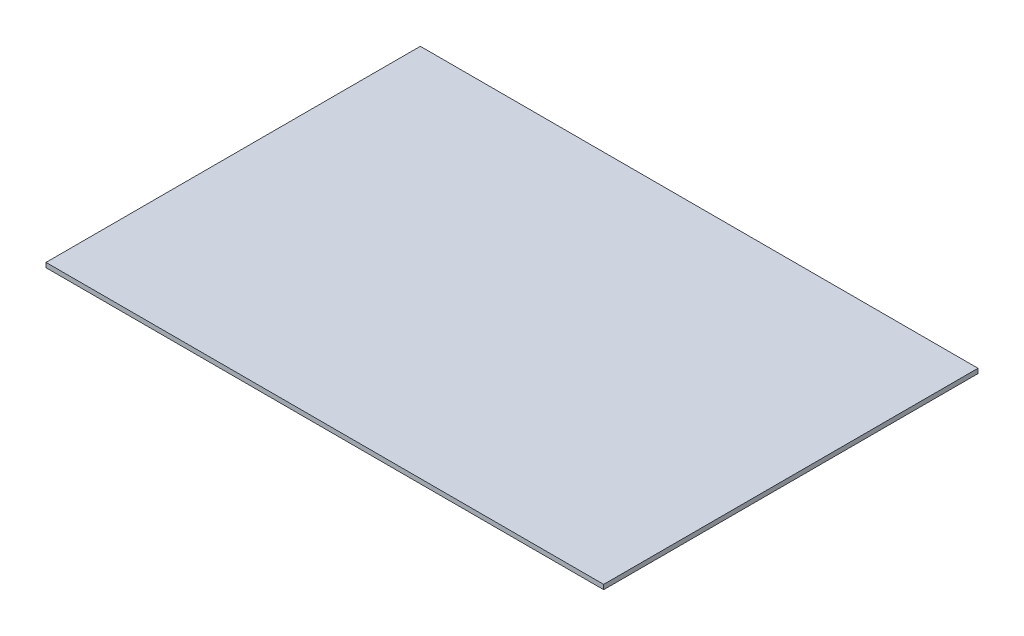
ISO-10303-21;
HEADER;
FILE_DESCRIPTION(('STEP AP214'),'2;1');
FILE_NAME('part.step','',(''),(''),'','','');
FILE_SCHEMA(('AUTOMOTIVE_DESIGN { 1 0 10303 214 1 1 1 1 }'));
ENDSEC;
DATA;
#1=APPLICATION_CONTEXT('core data for automotive mechanical design processes');
#2=APPLICATION_PROTOCOL_DEFINITION('international standard','automotive_design',2000,#1);
#3=PRODUCT_CONTEXT('',#1,'mechanical');
#4=PRODUCT('Part','Part','',(#3));
#5=PRODUCT_RELATED_PRODUCT_CATEGORY('part','',(#4));
#6=PRODUCT_DEFINITION_FORMATION('','',#4);
#7=PRODUCT_DEFINITION_CONTEXT('part definition',#1,'design');
#8=PRODUCT_DEFINITION('design','',#6,#7);
#9=PRODUCT_DEFINITION_SHAPE('','',#8);
#10=(LENGTH_UNIT() NAMED_UNIT(*) SI_UNIT(.MILLI.,.METRE.));
#11=(NAMED_UNIT(*) PLANE_ANGLE_UNIT() SI_UNIT($,.RADIAN.));
#12=(NAMED_UNIT(*) SI_UNIT($,.STERADIAN.) SOLID_ANGLE_UNIT());
#13=UNCERTAINTY_MEASURE_WITH_UNIT(LENGTH_MEASURE(1.E-05),#10,'distance_accuracy_value','');
#14=(GEOMETRIC_REPRESENTATION_CONTEXT(3) GLOBAL_UNCERTAINTY_ASSIGNED_CONTEXT((#13)) GLOBAL_UNIT_ASSIGNED_CONTEXT((#10,
#11,#12)) REPRESENTATION_CONTEXT('',''));
#15=CARTESIAN_POINT('',(0.,0.,0.));
#16=DIRECTION('',(0.,0.,1.));
#17=DIRECTION('',(1.,0.,0.));
#18=AXIS2_PLACEMENT_3D('',#15,#16,#17);
#19=CARTESIAN_POINT('',(-10.1599999999998,5.08,10.16));
#20=DIRECTION('',(1.,0.,0.));
#21=DIRECTION('',(0.,0.,-1.));
#22=AXIS2_PLACEMENT_3D('',#19,#20,#21);
#23=PLANE('',#22);
#24=DIRECTION('',(0.,0.,1.));
#25=VECTOR('',#24,1.);
#26=CARTESIAN_POINT('',(-10.1599999999998,0.,10.16));
#27=LINE('',#26,#25);
#28=CARTESIAN_POINT('',(-10.1599999999998,0.,-399.38));
#29=VERTEX_POINT('',#28);
#30=CARTESIAN_POINT('',(-10.1599999999998,0.,10.16));
#31=VERTEX_POINT('',#30);
#32=EDGE_CURVE('E100',#29,#31,#27,.T.);
#33=ORIENTED_EDGE('',*,*,#32,.T.);
#34=DIRECTION('',(0.,-1.,0.));
#35=VECTOR('',#34,1.);
#36=CARTESIAN_POINT('',(-10.1599999999998,5.08,10.16));
#37=LINE('',#36,#35);
#38=CARTESIAN_POINT('',(-10.1599999999998,5.08,10.16));
#39=VERTEX_POINT('',#38);
#40=EDGE_CURVE('E11',#39,#31,#37,.T.);
#41=ORIENTED_EDGE('',*,*,#40,.F.);
#42=DIRECTION('',(0.,0.,1.));
#43=VECTOR('',#42,1.);
#44=CARTESIAN_POINT('',(-10.1599999999998,5.08,10.16));
#45=LINE('',#44,#43);
#46=CARTESIAN_POINT('',(-10.1599999999998,5.08,-399.38));
#47=VERTEX_POINT('',#46);
#48=EDGE_CURVE('E88',#47,#39,#45,.T.);
#49=ORIENTED_EDGE('',*,*,#48,.F.);
#50=DIRECTION('',(0.,-1.,0.));
#51=VECTOR('',#50,1.);
#52=CARTESIAN_POINT('',(-10.1599999999998,5.08,-399.38));
#53=LINE('',#52,#51);
#54=EDGE_CURVE('E96',#47,#29,#53,.T.);
#55=ORIENTED_EDGE('',*,*,#54,.T.);
#56=EDGE_LOOP('',(#33,#41,#49,#55));
#57=FACE_BOUND('',#56,.T.);
#58=ADVANCED_FACE('F37',(#57),#23,.F.);
#59=CARTESIAN_POINT('',(-10.1599999999998,5.08,10.16));
#60=DIRECTION('',(0.,0.,-1.));
#61=DIRECTION('',(-1.,0.,0.));
#62=AXIS2_PLACEMENT_3D('',#59,#60,#61);
#63=PLANE('',#62);
#64=DIRECTION('',(1.,0.,0.));
#65=VECTOR('',#64,1.);
#66=CARTESIAN_POINT('',(-10.1599999999998,0.,10.16));
#67=LINE('',#66,#65);
#68=CARTESIAN_POINT('',(600.,0.,10.16));
#69=VERTEX_POINT('',#68);
#70=EDGE_CURVE('E92',#31,#69,#67,.T.);
#71=ORIENTED_EDGE('',*,*,#70,.T.);
#72=DIRECTION('',(0.,-1.,0.));
#73=VECTOR('',#72,1.);
#74=CARTESIAN_POINT('',(600.,5.08,10.16));
#75=LINE('',#74,#73);
#76=CARTESIAN_POINT('',(600.,5.08,10.16));
#77=VERTEX_POINT('',#76);
#78=EDGE_CURVE('E45',#77,#69,#75,.T.);
#79=ORIENTED_EDGE('',*,*,#78,.F.);
#80=DIRECTION('',(1.,0.,0.));
#81=VECTOR('',#80,1.);
#82=CARTESIAN_POINT('',(-10.1599999999998,5.08,10.16));
#83=LINE('',#82,#81);
#84=EDGE_CURVE('E83',#39,#77,#83,.T.);
#85=ORIENTED_EDGE('',*,*,#84,.F.);
#86=ORIENTED_EDGE('',*,*,#40,.T.);
#87=EDGE_LOOP('',(#71,#79,#85,#86));
#88=FACE_BOUND('',#87,.T.);
#89=ADVANCED_FACE('F91',(#88),#63,.F.);
#90=CARTESIAN_POINT('',(600.,5.08,10.16));
#91=DIRECTION('',(-1.,0.,0.));
#92=DIRECTION('',(0.,0.,1.));
#93=AXIS2_PLACEMENT_3D('',#90,#91,#92);
#94=PLANE('',#93);
#95=DIRECTION('',(0.,0.,-1.));
#96=VECTOR('',#95,1.);
#97=CARTESIAN_POINT('',(600.,0.,10.16));
#98=LINE('',#97,#96);
#99=CARTESIAN_POINT('',(600.,0.,-399.38));
#100=VERTEX_POINT('',#99);
#101=EDGE_CURVE('E70',#69,#100,#98,.T.);
#102=ORIENTED_EDGE('',*,*,#101,.T.);
#103=DIRECTION('',(0.,-1.,0.));
#104=VECTOR('',#103,1.);
#105=CARTESIAN_POINT('',(600.,5.08,-399.38));
#106=LINE('',#105,#104);
#107=CARTESIAN_POINT('',(600.,5.08,-399.38));
#108=VERTEX_POINT('',#107);
#109=EDGE_CURVE('E93',#108,#100,#106,.T.);
#110=ORIENTED_EDGE('',*,*,#109,.F.);
#111=DIRECTION('',(0.,0.,-1.));
#112=VECTOR('',#111,1.);
#113=CARTESIAN_POINT('',(600.,5.08,10.16));
#114=LINE('',#113,#112);
#115=EDGE_CURVE('E86',#77,#108,#114,.T.);
#116=ORIENTED_EDGE('',*,*,#115,.F.);
#117=ORIENTED_EDGE('',*,*,#78,.T.);
#118=EDGE_LOOP('',(#102,#110,#116,#117));
#119=FACE_BOUND('',#118,.T.);
#120=ADVANCED_FACE('F94',(#119),#94,.F.);
#121=CARTESIAN_POINT('',(-10.1599999999998,5.08,-399.38));
#122=DIRECTION('',(0.,0.,1.));
#123=DIRECTION('',(1.,0.,0.));
#124=AXIS2_PLACEMENT_3D('',#121,#122,#123);
#125=PLANE('',#124);
#126=DIRECTION('',(-1.,0.,0.));
#127=VECTOR('',#126,1.);
#128=CARTESIAN_POINT('',(-10.1599999999998,0.,-399.38));
#129=LINE('',#128,#127);
#130=EDGE_CURVE('E76',#100,#29,#129,.T.);
#131=ORIENTED_EDGE('',*,*,#130,.T.);
#132=ORIENTED_EDGE('',*,*,#54,.F.);
#133=DIRECTION('',(-1.,0.,0.));
#134=VECTOR('',#133,1.);
#135=CARTESIAN_POINT('',(-10.1599999999998,5.08,-399.38));
#136=LINE('',#135,#134);
#137=EDGE_CURVE('E53',#108,#47,#136,.T.);
#138=ORIENTED_EDGE('',*,*,#137,.F.);
#139=ORIENTED_EDGE('',*,*,#109,.T.);
#140=EDGE_LOOP('',(#131,#132,#138,#139));
#141=FACE_BOUND('',#140,.T.);
#142=ADVANCED_FACE('F107',(#141),#125,.F.);
#143=CARTESIAN_POINT('',(0.,5.08,0.));
#144=DIRECTION('',(0.,-1.,0.));
#145=DIRECTION('',(0.,0.,-1.));
#146=AXIS2_PLACEMENT_3D('',#143,#144,#145);
#147=PLANE('',#146);
#148=ORIENTED_EDGE('',*,*,#48,.T.);
#149=ORIENTED_EDGE('',*,*,#84,.T.);
#150=ORIENTED_EDGE('',*,*,#115,.T.);
#151=ORIENTED_EDGE('',*,*,#137,.T.);
#152=EDGE_LOOP('',(#148,#149,#150,#151));
#153=FACE_BOUND('',#152,.T.);
#154=ADVANCED_FACE('F84',(#153),#147,.F.);
#155=CARTESIAN_POINT('',(0.,0.,0.));
#156=DIRECTION('',(0.,-1.,0.));
#157=DIRECTION('',(0.,0.,-1.));
#158=AXIS2_PLACEMENT_3D('',#155,#156,#157);
#159=PLANE('',#158);
#160=ORIENTED_EDGE('',*,*,#32,.F.);
#161=ORIENTED_EDGE('',*,*,#130,.F.);
#162=ORIENTED_EDGE('',*,*,#101,.F.);
#163=ORIENTED_EDGE('',*,*,#70,.F.);
#164=EDGE_LOOP('',(#160,#161,#162,#163));
#165=FACE_BOUND('',#164,.T.);
#166=ADVANCED_FACE('F110',(#165),#159,.T.);
#167=CLOSED_SHELL('',(#58,#89,#120,#142,#154,#166));
#168=MANIFOLD_SOLID_BREP('B2',#167);
#169=ADVANCED_BREP_SHAPE_REPRESENTATION('',(#18,#168),#14);
#170=SHAPE_DEFINITION_REPRESENTATION(#9,#169);
ENDSEC;
END-ISO-10303-21;
